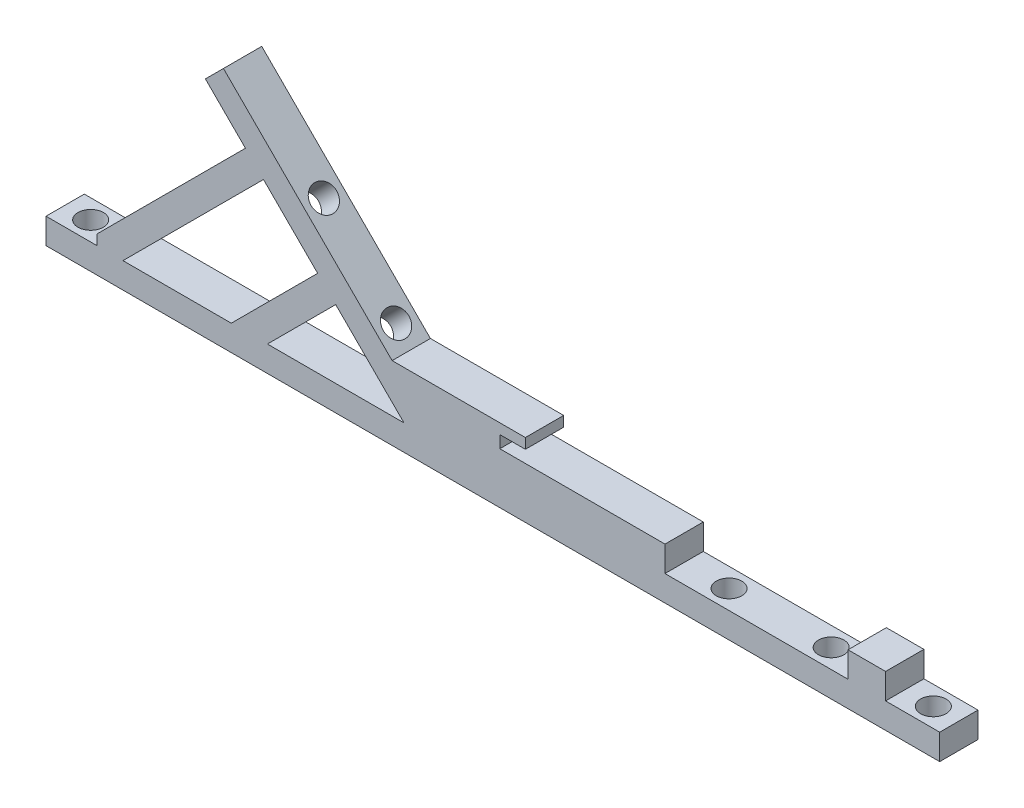
ISO-10303-21;
HEADER;
FILE_DESCRIPTION(('STEP AP214'),'2;1');
FILE_NAME('part.step','',(''),(''),'','','');
FILE_SCHEMA(('AUTOMOTIVE_DESIGN { 1 0 10303 214 1 1 1 1 }'));
ENDSEC;
DATA;
#1=APPLICATION_CONTEXT('core data for automotive mechanical design processes');
#2=APPLICATION_PROTOCOL_DEFINITION('international standard','automotive_design',2000,#1);
#3=PRODUCT_CONTEXT('',#1,'mechanical');
#4=PRODUCT('Part','Part','',(#3));
#5=PRODUCT_RELATED_PRODUCT_CATEGORY('part','',(#4));
#6=PRODUCT_DEFINITION_FORMATION('','',#4);
#7=PRODUCT_DEFINITION_CONTEXT('part definition',#1,'design');
#8=PRODUCT_DEFINITION('design','',#6,#7);
#9=PRODUCT_DEFINITION_SHAPE('','',#8);
#10=(LENGTH_UNIT() NAMED_UNIT(*) SI_UNIT(.MILLI.,.METRE.));
#11=(NAMED_UNIT(*) PLANE_ANGLE_UNIT() SI_UNIT($,.RADIAN.));
#12=(NAMED_UNIT(*) SI_UNIT($,.STERADIAN.) SOLID_ANGLE_UNIT());
#13=UNCERTAINTY_MEASURE_WITH_UNIT(LENGTH_MEASURE(1.E-05),#10,'distance_accuracy_value','');
#14=(GEOMETRIC_REPRESENTATION_CONTEXT(3) GLOBAL_UNCERTAINTY_ASSIGNED_CONTEXT((#13)) GLOBAL_UNIT_ASSIGNED_CONTEXT((#10,
#11,#12)) REPRESENTATION_CONTEXT('',''));
#15=CARTESIAN_POINT('',(0.,0.,0.));
#16=DIRECTION('',(0.,0.,1.));
#17=DIRECTION('',(1.,0.,0.));
#18=AXIS2_PLACEMENT_3D('',#15,#16,#17);
#19=CARTESIAN_POINT('',(0.,3.175,0.));
#20=DIRECTION('',(0.,-1.,0.));
#21=DIRECTION('',(0.,0.,-1.));
#22=AXIS2_PLACEMENT_3D('',#19,#20,#21);
#23=PLANE('',#22);
#24=CARTESIAN_POINT('',(0.,3.175,0.));
#25=DIRECTION('',(0.,1.,0.));
#26=DIRECTION('',(0.,0.,1.));
#27=AXIS2_PLACEMENT_3D('',#24,#25,#26);
#28=CIRCLE('',#27,1.5875);
#29=CARTESIAN_POINT('',(0.,3.175,1.5875));
#30=VERTEX_POINT('',#29);
#31=EDGE_CURVE('E562',#30,#30,#28,.T.);
#32=ORIENTED_EDGE('',*,*,#31,.F.);
#33=EDGE_LOOP('',(#32));
#34=FACE_BOUND('',#33,.T.);
#35=CARTESIAN_POINT('',(12.7,3.175,0.));
#36=DIRECTION('',(0.,1.,0.));
#37=DIRECTION('',(0.,0.,1.));
#38=AXIS2_PLACEMENT_3D('',#35,#36,#37);
#39=CIRCLE('',#38,1.5875);
#40=CARTESIAN_POINT('',(12.7,3.175,1.5875));
#41=VERTEX_POINT('',#40);
#42=EDGE_CURVE('E338',#41,#41,#39,.T.);
#43=ORIENTED_EDGE('',*,*,#42,.F.);
#44=EDGE_LOOP('',(#43));
#45=FACE_BOUND('',#44,.T.);
#46=DIRECTION('',(1.,0.,0.));
#47=VECTOR('',#46,1.);
#48=CARTESIAN_POINT('',(-82.55,3.175,2.38125));
#49=LINE('',#48,#47);
#50=CARTESIAN_POINT('',(-5.58425134997997,3.175,2.38125));
#51=VERTEX_POINT('',#50);
#52=CARTESIAN_POINT('',(17.1793113595147,3.175,2.38125));
#53=VERTEX_POINT('',#52);
#54=EDGE_CURVE('E75',#51,#53,#49,.T.);
#55=ORIENTED_EDGE('',*,*,#54,.T.);
#56=DIRECTION('',(0.,0.,1.));
#57=VECTOR('',#56,1.);
#58=CARTESIAN_POINT('',(17.1793113595147,3.175,-2.38125));
#59=LINE('',#58,#57);
#60=CARTESIAN_POINT('',(17.1793113595147,3.175,-2.38125));
#61=VERTEX_POINT('',#60);
#62=EDGE_CURVE('E296',#61,#53,#59,.T.);
#63=ORIENTED_EDGE('',*,*,#62,.F.);
#64=DIRECTION('',(-1.,0.,0.));
#65=VECTOR('',#64,1.);
#66=CARTESIAN_POINT('',(-82.55,3.175,-2.38125));
#67=LINE('',#66,#65);
#68=CARTESIAN_POINT('',(-5.58425134997997,3.175,-2.38125));
#69=VERTEX_POINT('',#68);
#70=EDGE_CURVE('E281',#61,#69,#67,.T.);
#71=ORIENTED_EDGE('',*,*,#70,.T.);
#72=DIRECTION('',(0.,0.,1.));
#73=VECTOR('',#72,1.);
#74=CARTESIAN_POINT('',(-5.58425134997997,3.175,-2.38125));
#75=LINE('',#74,#73);
#76=EDGE_CURVE('E501',#69,#51,#75,.T.);
#77=ORIENTED_EDGE('',*,*,#76,.T.);
#78=EDGE_LOOP('',(#55,#63,#71,#77));
#79=FACE_BOUND('',#78,.T.);
#80=ADVANCED_FACE('F46',(#34,#45,#79),#23,.F.);
#81=CARTESIAN_POINT('',(25.4,3.175,0.));
#82=DIRECTION('',(0.,1.,0.));
#83=DIRECTION('',(0.,0.,1.));
#84=AXIS2_PLACEMENT_3D('',#81,#82,#83);
#85=CIRCLE('',#84,1.5875);
#86=CARTESIAN_POINT('',(25.4,3.175,1.5875));
#87=VERTEX_POINT('',#86);
#88=EDGE_CURVE('E327',#87,#87,#85,.T.);
#89=ORIENTED_EDGE('',*,*,#88,.F.);
#90=EDGE_LOOP('',(#89));
#91=FACE_BOUND('',#90,.T.);
#92=CARTESIAN_POINT('',(28.575,3.175,-2.38125));
#93=VERTEX_POINT('',#92);
#94=CARTESIAN_POINT('',(21.8464961052884,3.175,-2.38125));
#95=VERTEX_POINT('',#94);
#96=EDGE_CURVE('E292',#93,#95,#67,.T.);
#97=ORIENTED_EDGE('',*,*,#96,.T.);
#98=DIRECTION('',(0.,0.,1.));
#99=VECTOR('',#98,1.);
#100=CARTESIAN_POINT('',(21.8464961052884,3.175,-2.38125));
#101=LINE('',#100,#99);
#102=CARTESIAN_POINT('',(21.8464961052884,3.175,2.38125));
#103=VERTEX_POINT('',#102);
#104=EDGE_CURVE('E65',#95,#103,#101,.T.);
#105=ORIENTED_EDGE('',*,*,#104,.T.);
#106=CARTESIAN_POINT('',(28.575,3.175,2.38125));
#107=VERTEX_POINT('',#106);
#108=EDGE_CURVE('E574',#103,#107,#49,.T.);
#109=ORIENTED_EDGE('',*,*,#108,.T.);
#110=DIRECTION('',(0.,0.,1.));
#111=VECTOR('',#110,1.);
#112=CARTESIAN_POINT('',(28.575,3.175,-2.38125));
#113=LINE('',#112,#111);
#114=EDGE_CURVE('E360',#93,#107,#113,.T.);
#115=ORIENTED_EDGE('',*,*,#114,.F.);
#116=EDGE_LOOP('',(#97,#105,#109,#115));
#117=FACE_BOUND('',#116,.T.);
#118=ADVANCED_FACE('F656',(#91,#117),#23,.F.);
#119=CARTESIAN_POINT('',(-55.0193596973271,3.175,2.38125));
#120=VERTEX_POINT('',#119);
#121=CARTESIAN_POINT('',(-38.033911485456,3.175,2.38125));
#122=VERTEX_POINT('',#121);
#123=EDGE_CURVE('E631',#120,#122,#49,.T.);
#124=ORIENTED_EDGE('',*,*,#123,.T.);
#125=DIRECTION('',(0.,0.,1.));
#126=VECTOR('',#125,1.);
#127=CARTESIAN_POINT('',(-38.033911485456,3.175,-2.38125));
#128=LINE('',#127,#126);
#129=CARTESIAN_POINT('',(-38.033911485456,3.175,-2.38125));
#130=VERTEX_POINT('',#129);
#131=EDGE_CURVE('E504',#130,#122,#128,.T.);
#132=ORIENTED_EDGE('',*,*,#131,.F.);
#133=CARTESIAN_POINT('',(-55.0193596973271,3.175,-2.38125));
#134=VERTEX_POINT('',#133);
#135=EDGE_CURVE('E293',#130,#134,#67,.T.);
#136=ORIENTED_EDGE('',*,*,#135,.T.);
#137=DIRECTION('',(0.,0.,1.));
#138=VECTOR('',#137,1.);
#139=CARTESIAN_POINT('',(-55.0193596973271,3.175,-2.38125));
#140=LINE('',#139,#138);
#141=EDGE_CURVE('E511',#134,#120,#140,.T.);
#142=ORIENTED_EDGE('',*,*,#141,.T.);
#143=EDGE_LOOP('',(#124,#132,#136,#142));
#144=FACE_BOUND('',#143,.T.);
#145=ADVANCED_FACE('F616',(#144),#23,.F.);
#146=CARTESIAN_POINT('',(-72.9798719394654,3.175,2.38125));
#147=VERTEX_POINT('',#146);
#148=CARTESIAN_POINT('',(-59.5094877578617,3.175,2.38125));
#149=VERTEX_POINT('',#148);
#150=EDGE_CURVE('E578',#147,#149,#49,.T.);
#151=ORIENTED_EDGE('',*,*,#150,.T.);
#152=DIRECTION('',(0.,0.,1.));
#153=VECTOR('',#152,1.);
#154=CARTESIAN_POINT('',(-59.5094877578617,3.175,-2.38125));
#155=LINE('',#154,#153);
#156=CARTESIAN_POINT('',(-59.5094877578617,3.175,-2.38125));
#157=VERTEX_POINT('',#156);
#158=EDGE_CURVE('E514',#157,#149,#155,.T.);
#159=ORIENTED_EDGE('',*,*,#158,.F.);
#160=CARTESIAN_POINT('',(-72.9798719394654,3.175,-2.38125));
#161=VERTEX_POINT('',#160);
#162=EDGE_CURVE('E609',#157,#161,#67,.T.);
#163=ORIENTED_EDGE('',*,*,#162,.T.);
#164=DIRECTION('',(0.,0.,1.));
#165=VECTOR('',#164,1.);
#166=CARTESIAN_POINT('',(-72.9798719394654,3.175,-2.38125));
#167=LINE('',#166,#165);
#168=EDGE_CURVE('E524',#161,#147,#167,.T.);
#169=ORIENTED_EDGE('',*,*,#168,.T.);
#170=EDGE_LOOP('',(#151,#159,#163,#169));
#171=FACE_BOUND('',#170,.T.);
#172=ADVANCED_FACE('F649',(#171),#23,.F.);
#173=CARTESIAN_POINT('',(-82.55,3.175,2.38125));
#174=VERTEX_POINT('',#173);
#175=CARTESIAN_POINT('',(-76.185480906041,3.175,2.38125));
#176=VERTEX_POINT('',#175);
#177=EDGE_CURVE('E576',#174,#176,#49,.T.);
#178=ORIENTED_EDGE('',*,*,#177,.T.);
#179=DIRECTION('',(0.,0.,1.));
#180=VECTOR('',#179,1.);
#181=CARTESIAN_POINT('',(-76.185480906041,3.175,-2.38125));
#182=LINE('',#181,#180);
#183=CARTESIAN_POINT('',(-76.185480906041,3.175,-2.38125));
#184=VERTEX_POINT('',#183);
#185=EDGE_CURVE('E527',#184,#176,#182,.T.);
#186=ORIENTED_EDGE('',*,*,#185,.F.);
#187=CARTESIAN_POINT('',(-82.55,3.175,-2.38125));
#188=VERTEX_POINT('',#187);
#189=EDGE_CURVE('E295',#184,#188,#67,.T.);
#190=ORIENTED_EDGE('',*,*,#189,.T.);
#191=DIRECTION('',(0.,0.,1.));
#192=VECTOR('',#191,1.);
#193=CARTESIAN_POINT('',(-82.55,3.175,2.38125));
#194=LINE('',#193,#192);
#195=EDGE_CURVE('E570',#188,#174,#194,.T.);
#196=ORIENTED_EDGE('',*,*,#195,.T.);
#197=EDGE_LOOP('',(#178,#186,#190,#196));
#198=FACE_BOUND('',#197,.T.);
#199=CARTESIAN_POINT('',(-79.375,3.175,0.));
#200=DIRECTION('',(0.,1.,0.));
#201=DIRECTION('',(0.,0.,1.));
#202=AXIS2_PLACEMENT_3D('',#199,#200,#201);
#203=CIRCLE('',#202,1.5875);
#204=CARTESIAN_POINT('',(-79.375,3.175,1.5875));
#205=VERTEX_POINT('',#204);
#206=EDGE_CURVE('E554',#205,#205,#203,.T.);
#207=ORIENTED_EDGE('',*,*,#206,.F.);
#208=EDGE_LOOP('',(#207));
#209=FACE_BOUND('',#208,.T.);
#210=ADVANCED_FACE('F605',(#198,#209),#23,.F.);
#211=CARTESIAN_POINT('',(0.,0.,0.));
#212=DIRECTION('',(0.,-1.,0.));
#213=DIRECTION('',(0.,0.,-1.));
#214=AXIS2_PLACEMENT_3D('',#211,#212,#213);
#215=PLANE('',#214);
#216=CARTESIAN_POINT('',(12.7,0.,0.));
#217=DIRECTION('',(0.,1.,0.));
#218=DIRECTION('',(0.,0.,1.));
#219=AXIS2_PLACEMENT_3D('',#216,#217,#218);
#220=CIRCLE('',#219,1.5875);
#221=CARTESIAN_POINT('',(12.7,0.,1.5875));
#222=VERTEX_POINT('',#221);
#223=EDGE_CURVE('E333',#222,#222,#220,.T.);
#224=ORIENTED_EDGE('',*,*,#223,.T.);
#225=EDGE_LOOP('',(#224));
#226=FACE_BOUND('',#225,.T.);
#227=CARTESIAN_POINT('',(25.4,0.,0.));
#228=DIRECTION('',(0.,1.,0.));
#229=DIRECTION('',(0.,0.,1.));
#230=AXIS2_PLACEMENT_3D('',#227,#228,#229);
#231=CIRCLE('',#230,1.5875);
#232=CARTESIAN_POINT('',(25.4,0.,1.5875));
#233=VERTEX_POINT('',#232);
#234=EDGE_CURVE('E342',#233,#233,#231,.T.);
#235=ORIENTED_EDGE('',*,*,#234,.T.);
#236=EDGE_LOOP('',(#235));
#237=FACE_BOUND('',#236,.T.);
#238=CARTESIAN_POINT('',(0.,0.,0.));
#239=DIRECTION('',(0.,1.,0.));
#240=DIRECTION('',(0.,0.,1.));
#241=AXIS2_PLACEMENT_3D('',#238,#239,#240);
#242=CIRCLE('',#241,1.5875);
#243=CARTESIAN_POINT('',(0.,0.,1.5875));
#244=VERTEX_POINT('',#243);
#245=EDGE_CURVE('E558',#244,#244,#242,.T.);
#246=ORIENTED_EDGE('',*,*,#245,.T.);
#247=EDGE_LOOP('',(#246));
#248=FACE_BOUND('',#247,.T.);
#249=DIRECTION('',(0.,0.,1.));
#250=VECTOR('',#249,1.);
#251=CARTESIAN_POINT('',(-82.55,0.,2.38125));
#252=LINE('',#251,#250);
#253=CARTESIAN_POINT('',(-82.55,0.,-2.38125));
#254=VERTEX_POINT('',#253);
#255=CARTESIAN_POINT('',(-82.55,0.,2.38125));
#256=VERTEX_POINT('',#255);
#257=EDGE_CURVE('E566',#254,#256,#252,.T.);
#258=ORIENTED_EDGE('',*,*,#257,.F.);
#259=DIRECTION('',(-1.,0.,0.));
#260=VECTOR('',#259,1.);
#261=CARTESIAN_POINT('',(-82.55,0.,-2.38125));
#262=LINE('',#261,#260);
#263=CARTESIAN_POINT('',(28.575,0.,-2.38125));
#264=VERTEX_POINT('',#263);
#265=EDGE_CURVE('E575',#264,#254,#262,.T.);
#266=ORIENTED_EDGE('',*,*,#265,.F.);
#267=DIRECTION('',(0.,0.,-1.));
#268=VECTOR('',#267,1.);
#269=CARTESIAN_POINT('',(28.575,0.,2.38125));
#270=LINE('',#269,#268);
#271=CARTESIAN_POINT('',(28.575,0.,2.38125));
#272=VERTEX_POINT('',#271);
#273=EDGE_CURVE('E352',#272,#264,#270,.T.);
#274=ORIENTED_EDGE('',*,*,#273,.F.);
#275=DIRECTION('',(1.,0.,0.));
#276=VECTOR('',#275,1.);
#277=CARTESIAN_POINT('',(-82.55,0.,2.38125));
#278=LINE('',#277,#276);
#279=EDGE_CURVE('E584',#256,#272,#278,.T.);
#280=ORIENTED_EDGE('',*,*,#279,.F.);
#281=EDGE_LOOP('',(#258,#266,#274,#280));
#282=FACE_BOUND('',#281,.T.);
#283=CARTESIAN_POINT('',(-79.375,0.,0.));
#284=DIRECTION('',(0.,1.,0.));
#285=DIRECTION('',(0.,0.,1.));
#286=AXIS2_PLACEMENT_3D('',#283,#284,#285);
#287=CIRCLE('',#286,1.5875);
#288=CARTESIAN_POINT('',(-79.375,0.,1.5875));
#289=VERTEX_POINT('',#288);
#290=EDGE_CURVE('E497',#289,#289,#287,.T.);
#291=ORIENTED_EDGE('',*,*,#290,.T.);
#292=EDGE_LOOP('',(#291));
#293=FACE_BOUND('',#292,.T.);
#294=ADVANCED_FACE('F596',(#226,#237,#248,#282,#293),#215,.T.);
#295=CARTESIAN_POINT('',(-82.55,3.175,2.38125));
#296=DIRECTION('',(1.,0.,0.));
#297=DIRECTION('',(0.,0.,-1.));
#298=AXIS2_PLACEMENT_3D('',#295,#296,#297);
#299=PLANE('',#298);
#300=ORIENTED_EDGE('',*,*,#257,.T.);
#301=DIRECTION('',(0.,-1.,0.));
#302=VECTOR('',#301,1.);
#303=CARTESIAN_POINT('',(-82.55,3.175,2.38125));
#304=LINE('',#303,#302);
#305=EDGE_CURVE('E12',#174,#256,#304,.T.);
#306=ORIENTED_EDGE('',*,*,#305,.F.);
#307=ORIENTED_EDGE('',*,*,#195,.F.);
#308=DIRECTION('',(0.,-1.,0.));
#309=VECTOR('',#308,1.);
#310=CARTESIAN_POINT('',(-82.55,3.175,-2.38125));
#311=LINE('',#310,#309);
#312=EDGE_CURVE('E55',#188,#254,#311,.T.);
#313=ORIENTED_EDGE('',*,*,#312,.T.);
#314=EDGE_LOOP('',(#300,#306,#307,#313));
#315=FACE_BOUND('',#314,.T.);
#316=ADVANCED_FACE('F48',(#315),#299,.F.);
#317=CARTESIAN_POINT('',(-82.55,3.175,2.38125));
#318=DIRECTION('',(0.,0.,-1.));
#319=DIRECTION('',(-1.,0.,0.));
#320=AXIS2_PLACEMENT_3D('',#317,#318,#319);
#321=PLANE('',#320);
#322=DIRECTION('',(0.707106781186546,-0.707106781186549,0.));
#323=VECTOR('',#322,1.);
#324=CARTESIAN_POINT('',(-17.4294557427281,-17.429455742728,2.38125));
#325=LINE('',#324,#323);
#326=CARTESIAN_POINT('',(-46.5266355913915,11.6677241059355,2.38125));
#327=VERTEX_POINT('',#326);
#328=EDGE_CURVE('E466',#327,#122,#325,.T.);
#329=ORIENTED_EDGE('',*,*,#328,.T.);
#330=ORIENTED_EDGE('',*,*,#123,.F.);
#331=DIRECTION('',(-0.707106781186549,-0.707106781186546,0.));
#332=VECTOR('',#331,1.);
#333=CARTESIAN_POINT('',(-29.0971798486634,29.0971798486636,2.38125));
#334=LINE('',#333,#332);
#335=EDGE_CURVE('E483',#327,#120,#334,.T.);
#336=ORIENTED_EDGE('',*,*,#335,.F.);
#337=EDGE_LOOP('',(#329,#330,#336));
#338=FACE_BOUND('',#337,.T.);
#339=DIRECTION('',(-0.707106781186549,-0.707106781186546,0.));
#340=VECTOR('',#339,1.);
#341=CARTESIAN_POINT('',(-31.3422438789307,31.3422438789309,2.38125));
#342=LINE('',#341,#340);
#343=CARTESIAN_POINT('',(-48.7716996216588,13.9127881362028,2.38125));
#344=VERTEX_POINT('',#343);
#345=EDGE_CURVE('E479',#344,#149,#342,.T.);
#346=ORIENTED_EDGE('',*,*,#345,.T.);
#347=ORIENTED_EDGE('',*,*,#150,.F.);
#348=DIRECTION('',(-0.707106781186549,-0.707106781186546,0.));
#349=VECTOR('',#348,1.);
#350=CARTESIAN_POINT('',(-38.0774359697326,38.0774359697327,2.38125));
#351=LINE('',#350,#349);
#352=CARTESIAN_POINT('',(-55.5068917124607,20.6479802270047,2.38125));
#353=VERTEX_POINT('',#352);
#354=EDGE_CURVE('E475',#353,#147,#351,.T.);
#355=ORIENTED_EDGE('',*,*,#354,.F.);
#356=EDGE_CURVE('E467',#353,#344,#325,.T.);
#357=ORIENTED_EDGE('',*,*,#356,.T.);
#358=EDGE_LOOP('',(#346,#347,#355,#357));
#359=FACE_BOUND('',#358,.T.);
#360=ORIENTED_EDGE('',*,*,#279,.T.);
#361=DIRECTION('',(0.,-1.,0.));
#362=VECTOR('',#361,1.);
#363=CARTESIAN_POINT('',(28.575,3.175,2.38125));
#364=LINE('',#363,#362);
#365=EDGE_CURVE('E337',#107,#272,#364,.T.);
#366=ORIENTED_EDGE('',*,*,#365,.F.);
#367=ORIENTED_EDGE('',*,*,#108,.F.);
#368=DIRECTION('',(0.,1.,0.));
#369=VECTOR('',#368,1.);
#370=CARTESIAN_POINT('',(21.8464961052884,3.175,2.38125));
#371=LINE('',#370,#369);
#372=CARTESIAN_POINT('',(21.8464961052884,6.35,2.38125));
#373=VERTEX_POINT('',#372);
#374=EDGE_CURVE('E314',#103,#373,#371,.T.);
#375=ORIENTED_EDGE('',*,*,#374,.T.);
#376=DIRECTION('',(-1.,0.,0.));
#377=VECTOR('',#376,1.);
#378=CARTESIAN_POINT('',(17.1793113595147,6.35,2.38125));
#379=LINE('',#378,#377);
#380=CARTESIAN_POINT('',(17.1793113595147,6.35,2.38125));
#381=VERTEX_POINT('',#380);
#382=EDGE_CURVE('E307',#373,#381,#379,.T.);
#383=ORIENTED_EDGE('',*,*,#382,.T.);
#384=DIRECTION('',(0.,-1.,0.));
#385=VECTOR('',#384,1.);
#386=CARTESIAN_POINT('',(17.1793113595147,3.175,2.38125));
#387=LINE('',#386,#385);
#388=EDGE_CURVE('E319',#381,#53,#387,.T.);
#389=ORIENTED_EDGE('',*,*,#388,.T.);
#390=ORIENTED_EDGE('',*,*,#54,.F.);
#391=DIRECTION('',(0.,1.,0.));
#392=VECTOR('',#391,1.);
#393=CARTESIAN_POINT('',(-5.58425134997997,0.,2.38125));
#394=LINE('',#393,#392);
#395=CARTESIAN_POINT('',(-5.58425134997997,6.35,2.38125));
#396=VERTEX_POINT('',#395);
#397=EDGE_CURVE('E487',#51,#396,#394,.T.);
#398=ORIENTED_EDGE('',*,*,#397,.T.);
#399=DIRECTION('',(-1.,0.,0.));
#400=VECTOR('',#399,1.);
#401=CARTESIAN_POINT('',(0.,6.35,2.38125));
#402=LINE('',#401,#400);
#403=CARTESIAN_POINT('',(-26.1180443421682,6.35,2.38125));
#404=VERTEX_POINT('',#403);
#405=EDGE_CURVE('E386',#396,#404,#402,.T.);
#406=ORIENTED_EDGE('',*,*,#405,.T.);
#407=DIRECTION('',(0.,1.,0.));
#408=VECTOR('',#407,1.);
#409=CARTESIAN_POINT('',(-26.1180443421682,0.,2.38125));
#410=LINE('',#409,#408);
#411=CARTESIAN_POINT('',(-26.1180443421682,7.874,2.38125));
#412=VERTEX_POINT('',#411);
#413=EDGE_CURVE('E369',#404,#412,#410,.T.);
#414=ORIENTED_EDGE('',*,*,#413,.T.);
#415=DIRECTION('',(1.,0.,0.));
#416=VECTOR('',#415,1.);
#417=CARTESIAN_POINT('',(0.,7.874,2.38125));
#418=LINE('',#417,#416);
#419=CARTESIAN_POINT('',(-22.9430443421682,7.874,2.38125));
#420=VERTEX_POINT('',#419);
#421=EDGE_CURVE('E441',#412,#420,#418,.T.);
#422=ORIENTED_EDGE('',*,*,#421,.T.);
#423=DIRECTION('',(0.,1.,0.));
#424=VECTOR('',#423,1.);
#425=CARTESIAN_POINT('',(-22.9430443421682,0.,2.38125));
#426=LINE('',#425,#424);
#427=CARTESIAN_POINT('',(-22.9430443421682,9.144,2.38125));
#428=VERTEX_POINT('',#427);
#429=EDGE_CURVE('E445',#420,#428,#426,.T.);
#430=ORIENTED_EDGE('',*,*,#429,.T.);
#431=DIRECTION('',(1.,0.,0.));
#432=VECTOR('',#431,1.);
#433=CARTESIAN_POINT('',(0.,9.144,2.38125));
#434=LINE('',#433,#432);
#435=CARTESIAN_POINT('',(-39.5127834249214,9.14399999999999,2.38125));
#436=VERTEX_POINT('',#435);
#437=EDGE_CURVE('E449',#436,#428,#434,.T.);
#438=ORIENTED_EDGE('',*,*,#437,.F.);
#439=DIRECTION('',(-0.707106781186547,0.707106781186549,0.));
#440=VECTOR('',#439,1.);
#441=CARTESIAN_POINT('',(-15.1843917124608,-15.1843917124607,2.38125));
#442=LINE('',#441,#440);
#443=CARTESIAN_POINT('',(-60.4845517881289,30.1157683632075,2.38125));
#444=VERTEX_POINT('',#443);
#445=EDGE_CURVE('E453',#436,#444,#442,.T.);
#446=ORIENTED_EDGE('',*,*,#445,.T.);
#447=DIRECTION('',(-0.707106781186548,-0.707106781186547,0.));
#448=VECTOR('',#447,1.);
#449=CARTESIAN_POINT('',(-45.3001600756681,45.3001600756682,2.38125));
#450=LINE('',#449,#448);
#451=CARTESIAN_POINT('',(-62.7296158183961,27.8707043329402,2.38125));
#452=VERTEX_POINT('',#451);
#453=EDGE_CURVE('E457',#444,#452,#450,.T.);
#454=ORIENTED_EDGE('',*,*,#453,.T.);
#455=CARTESIAN_POINT('',(-57.751955742728,22.893044257272,2.38125));
#456=VERTEX_POINT('',#455);
#457=EDGE_CURVE('E461',#452,#456,#325,.T.);
#458=ORIENTED_EDGE('',*,*,#457,.T.);
#459=DIRECTION('',(-0.707106781186549,-0.707106781186546,0.));
#460=VECTOR('',#459,1.);
#461=CARTESIAN_POINT('',(-40.3224999999998,40.3225,2.38125));
#462=LINE('',#461,#460);
#463=CARTESIAN_POINT('',(-76.185480906041,4.45951909395904,2.38125));
#464=VERTEX_POINT('',#463);
#465=EDGE_CURVE('E465',#456,#464,#462,.T.);
#466=ORIENTED_EDGE('',*,*,#465,.T.);
#467=DIRECTION('',(0.,-1.,0.));
#468=VECTOR('',#467,1.);
#469=CARTESIAN_POINT('',(-76.185480906041,0.,2.38125));
#470=LINE('',#469,#468);
#471=EDGE_CURVE('E471',#464,#176,#470,.T.);
#472=ORIENTED_EDGE('',*,*,#471,.T.);
#473=ORIENTED_EDGE('',*,*,#177,.F.);
#474=ORIENTED_EDGE('',*,*,#305,.T.);
#475=EDGE_LOOP('',(#360,#366,#367,#375,#383,#389,#390,#398,#406,#414,#422,#430,#438,#446,#454,
#458,#466,#472,#473,#474));
#476=FACE_BOUND('',#475,.T.);
#477=ADVANCED_FACE('F601',(#338,#359,#476),#321,.F.);
#478=CARTESIAN_POINT('',(-82.55,3.175,-2.38125));
#479=DIRECTION('',(0.,0.,1.));
#480=DIRECTION('',(1.,0.,0.));
#481=AXIS2_PLACEMENT_3D('',#478,#479,#480);
#482=PLANE('',#481);
#483=ORIENTED_EDGE('',*,*,#135,.F.);
#484=DIRECTION('',(0.707106781186546,-0.707106781186549,0.));
#485=VECTOR('',#484,1.);
#486=CARTESIAN_POINT('',(-17.4294557427281,-17.429455742728,-2.38125));
#487=LINE('',#486,#485);
#488=CARTESIAN_POINT('',(-46.5266355913915,11.6677241059355,-2.38125));
#489=VERTEX_POINT('',#488);
#490=EDGE_CURVE('E410',#489,#130,#487,.T.);
#491=ORIENTED_EDGE('',*,*,#490,.F.);
#492=DIRECTION('',(-0.707106781186549,-0.707106781186546,0.));
#493=VECTOR('',#492,1.);
#494=CARTESIAN_POINT('',(-29.0971798486634,29.0971798486636,-2.38125));
#495=LINE('',#494,#493);
#496=EDGE_CURVE('E427',#489,#134,#495,.T.);
#497=ORIENTED_EDGE('',*,*,#496,.T.);
#498=EDGE_LOOP('',(#483,#491,#497));
#499=FACE_BOUND('',#498,.T.);
#500=ORIENTED_EDGE('',*,*,#162,.F.);
#501=DIRECTION('',(-0.707106781186549,-0.707106781186546,0.));
#502=VECTOR('',#501,1.);
#503=CARTESIAN_POINT('',(-31.3422438789307,31.3422438789309,-2.38125));
#504=LINE('',#503,#502);
#505=CARTESIAN_POINT('',(-48.7716996216588,13.9127881362028,-2.38125));
#506=VERTEX_POINT('',#505);
#507=EDGE_CURVE('E423',#506,#157,#504,.T.);
#508=ORIENTED_EDGE('',*,*,#507,.F.);
#509=CARTESIAN_POINT('',(-55.5068917124607,20.6479802270047,-2.38125));
#510=VERTEX_POINT('',#509);
#511=EDGE_CURVE('E411',#510,#506,#487,.T.);
#512=ORIENTED_EDGE('',*,*,#511,.F.);
#513=DIRECTION('',(-0.707106781186549,-0.707106781186546,0.));
#514=VECTOR('',#513,1.);
#515=CARTESIAN_POINT('',(-38.0774359697326,38.0774359697327,-2.38125));
#516=LINE('',#515,#514);
#517=EDGE_CURVE('E419',#510,#161,#516,.T.);
#518=ORIENTED_EDGE('',*,*,#517,.T.);
#519=EDGE_LOOP('',(#500,#508,#512,#518));
#520=FACE_BOUND('',#519,.T.);
#521=ORIENTED_EDGE('',*,*,#265,.T.);
#522=ORIENTED_EDGE('',*,*,#312,.F.);
#523=ORIENTED_EDGE('',*,*,#189,.F.);
#524=DIRECTION('',(0.,-1.,0.));
#525=VECTOR('',#524,1.);
#526=CARTESIAN_POINT('',(-76.185480906041,0.,-2.38125));
#527=LINE('',#526,#525);
#528=CARTESIAN_POINT('',(-76.185480906041,4.45951909395904,-2.38125));
#529=VERTEX_POINT('',#528);
#530=EDGE_CURVE('E415',#529,#184,#527,.T.);
#531=ORIENTED_EDGE('',*,*,#530,.F.);
#532=DIRECTION('',(-0.707106781186549,-0.707106781186546,0.));
#533=VECTOR('',#532,1.);
#534=CARTESIAN_POINT('',(-40.3224999999998,40.3225,-2.38125));
#535=LINE('',#534,#533);
#536=CARTESIAN_POINT('',(-57.751955742728,22.893044257272,-2.38125));
#537=VERTEX_POINT('',#536);
#538=EDGE_CURVE('E409',#537,#529,#535,.T.);
#539=ORIENTED_EDGE('',*,*,#538,.F.);
#540=CARTESIAN_POINT('',(-62.7296158183961,27.8707043329402,-2.38125));
#541=VERTEX_POINT('',#540);
#542=EDGE_CURVE('E405',#541,#537,#487,.T.);
#543=ORIENTED_EDGE('',*,*,#542,.F.);
#544=DIRECTION('',(-0.707106781186548,-0.707106781186547,0.));
#545=VECTOR('',#544,1.);
#546=CARTESIAN_POINT('',(-45.3001600756681,45.3001600756682,-2.38125));
#547=LINE('',#546,#545);
#548=CARTESIAN_POINT('',(-60.4845517881289,30.1157683632075,-2.38125));
#549=VERTEX_POINT('',#548);
#550=EDGE_CURVE('E401',#549,#541,#547,.T.);
#551=ORIENTED_EDGE('',*,*,#550,.F.);
#552=DIRECTION('',(-0.707106781186547,0.707106781186549,0.));
#553=VECTOR('',#552,1.);
#554=CARTESIAN_POINT('',(-15.1843917124608,-15.1843917124607,-2.38125));
#555=LINE('',#554,#553);
#556=CARTESIAN_POINT('',(-39.5127834249214,9.14399999999999,-2.38125));
#557=VERTEX_POINT('',#556);
#558=EDGE_CURVE('E397',#557,#549,#555,.T.);
#559=ORIENTED_EDGE('',*,*,#558,.F.);
#560=DIRECTION('',(1.,0.,0.));
#561=VECTOR('',#560,1.);
#562=CARTESIAN_POINT('',(0.,9.144,-2.38125));
#563=LINE('',#562,#561);
#564=CARTESIAN_POINT('',(-22.9430443421682,9.144,-2.38125));
#565=VERTEX_POINT('',#564);
#566=EDGE_CURVE('E394',#557,#565,#563,.T.);
#567=ORIENTED_EDGE('',*,*,#566,.T.);
#568=DIRECTION('',(0.,1.,0.));
#569=VECTOR('',#568,1.);
#570=CARTESIAN_POINT('',(-22.9430443421682,0.,-2.38125));
#571=LINE('',#570,#569);
#572=CARTESIAN_POINT('',(-22.9430443421682,7.874,-2.38125));
#573=VERTEX_POINT('',#572);
#574=EDGE_CURVE('E390',#573,#565,#571,.T.);
#575=ORIENTED_EDGE('',*,*,#574,.F.);
#576=DIRECTION('',(1.,0.,0.));
#577=VECTOR('',#576,1.);
#578=CARTESIAN_POINT('',(0.,7.874,-2.38125));
#579=LINE('',#578,#577);
#580=CARTESIAN_POINT('',(-26.1180443421682,7.874,-2.38125));
#581=VERTEX_POINT('',#580);
#582=EDGE_CURVE('E385',#581,#573,#579,.T.);
#583=ORIENTED_EDGE('',*,*,#582,.F.);
#584=DIRECTION('',(0.,1.,0.));
#585=VECTOR('',#584,1.);
#586=CARTESIAN_POINT('',(-26.1180443421682,0.,-2.38125));
#587=LINE('',#586,#585);
#588=CARTESIAN_POINT('',(-26.1180443421682,6.35,-2.38125));
#589=VERTEX_POINT('',#588);
#590=EDGE_CURVE('E381',#589,#581,#587,.T.);
#591=ORIENTED_EDGE('',*,*,#590,.F.);
#592=DIRECTION('',(-1.,0.,0.));
#593=VECTOR('',#592,1.);
#594=CARTESIAN_POINT('',(0.,6.35,-2.38125));
#595=LINE('',#594,#593);
#596=CARTESIAN_POINT('',(-5.58425134997997,6.35,-2.38125));
#597=VERTEX_POINT('',#596);
#598=EDGE_CURVE('E433',#597,#589,#595,.T.);
#599=ORIENTED_EDGE('',*,*,#598,.F.);
#600=DIRECTION('',(0.,1.,0.));
#601=VECTOR('',#600,1.);
#602=CARTESIAN_POINT('',(-5.58425134997997,0.,-2.38125));
#603=LINE('',#602,#601);
#604=EDGE_CURVE('E289',#69,#597,#603,.T.);
#605=ORIENTED_EDGE('',*,*,#604,.F.);
#606=ORIENTED_EDGE('',*,*,#70,.F.);
#607=DIRECTION('',(0.,-1.,0.));
#608=VECTOR('',#607,1.);
#609=CARTESIAN_POINT('',(17.1793113595147,3.175,-2.38125));
#610=LINE('',#609,#608);
#611=CARTESIAN_POINT('',(17.1793113595147,6.35,-2.38125));
#612=VERTEX_POINT('',#611);
#613=EDGE_CURVE('E285',#612,#61,#610,.T.);
#614=ORIENTED_EDGE('',*,*,#613,.F.);
#615=DIRECTION('',(-1.,0.,0.));
#616=VECTOR('',#615,1.);
#617=CARTESIAN_POINT('',(17.1793113595147,6.35,-2.38125));
#618=LINE('',#617,#616);
#619=CARTESIAN_POINT('',(21.8464961052884,6.35,-2.38125));
#620=VERTEX_POINT('',#619);
#621=EDGE_CURVE('E301',#620,#612,#618,.T.);
#622=ORIENTED_EDGE('',*,*,#621,.F.);
#623=DIRECTION('',(0.,1.,0.));
#624=VECTOR('',#623,1.);
#625=CARTESIAN_POINT('',(21.8464961052884,3.175,-2.38125));
#626=LINE('',#625,#624);
#627=EDGE_CURVE('E306',#95,#620,#626,.T.);
#628=ORIENTED_EDGE('',*,*,#627,.F.);
#629=ORIENTED_EDGE('',*,*,#96,.F.);
#630=DIRECTION('',(0.,1.,0.));
#631=VECTOR('',#630,1.);
#632=CARTESIAN_POINT('',(28.575,0.,-2.38125));
#633=LINE('',#632,#631);
#634=EDGE_CURVE('E356',#264,#93,#633,.T.);
#635=ORIENTED_EDGE('',*,*,#634,.F.);
#636=EDGE_LOOP('',(#521,#522,#523,#531,#539,#543,#551,#559,#567,#575,#583,#591,#599,#605,#606,
#614,#622,#628,#629,#635));
#637=FACE_BOUND('',#636,.T.);
#638=ADVANCED_FACE('F282',(#499,#520,#637),#482,.F.);
#639=CARTESIAN_POINT('',(0.,3.175,0.));
#640=DIRECTION('',(0.,-1.,0.));
#641=DIRECTION('',(0.,0.,-1.));
#642=AXIS2_PLACEMENT_3D('',#639,#640,#641);
#643=CYLINDRICAL_SURFACE('',#642,1.5875);
#644=ORIENTED_EDGE('',*,*,#31,.T.);
#645=EDGE_LOOP('',(#644));
#646=FACE_BOUND('',#645,.T.);
#647=ORIENTED_EDGE('',*,*,#245,.F.);
#648=EDGE_LOOP('',(#647));
#649=FACE_BOUND('',#648,.T.);
#650=ADVANCED_FACE('F768',(#646,#649),#643,.F.);
#651=CARTESIAN_POINT('',(-79.375,3.175,0.));
#652=DIRECTION('',(0.,-1.,0.));
#653=DIRECTION('',(0.,0.,-1.));
#654=AXIS2_PLACEMENT_3D('',#651,#652,#653);
#655=CYLINDRICAL_SURFACE('',#654,1.5875);
#656=ORIENTED_EDGE('',*,*,#206,.T.);
#657=EDGE_LOOP('',(#656));
#658=FACE_BOUND('',#657,.T.);
#659=ORIENTED_EDGE('',*,*,#290,.F.);
#660=EDGE_LOOP('',(#659));
#661=FACE_BOUND('',#660,.T.);
#662=ADVANCED_FACE('F943',(#658,#661),#655,.F.);
#663=CARTESIAN_POINT('',(-26.1180443421682,0.,-2.38125));
#664=DIRECTION('',(1.,0.,0.));
#665=DIRECTION('',(0.,0.,-1.));
#666=AXIS2_PLACEMENT_3D('',#663,#664,#665);
#667=PLANE('',#666);
#668=ORIENTED_EDGE('',*,*,#413,.F.);
#669=DIRECTION('',(0.,0.,1.));
#670=VECTOR('',#669,1.);
#671=CARTESIAN_POINT('',(-26.1180443421682,6.35,-2.38125));
#672=LINE('',#671,#670);
#673=EDGE_CURVE('E494',#589,#404,#672,.T.);
#674=ORIENTED_EDGE('',*,*,#673,.F.);
#675=ORIENTED_EDGE('',*,*,#590,.T.);
#676=DIRECTION('',(0.,0.,1.));
#677=VECTOR('',#676,1.);
#678=CARTESIAN_POINT('',(-26.1180443421682,7.874,-2.38125));
#679=LINE('',#678,#677);
#680=EDGE_CURVE('E437',#581,#412,#679,.T.);
#681=ORIENTED_EDGE('',*,*,#680,.T.);
#682=EDGE_LOOP('',(#668,#674,#675,#681));
#683=FACE_BOUND('',#682,.T.);
#684=ADVANCED_FACE('F676',(#683),#667,.T.);
#685=CARTESIAN_POINT('',(0.,6.35,-2.38125));
#686=DIRECTION('',(0.,1.,0.));
#687=DIRECTION('',(-1.,0.,0.));
#688=AXIS2_PLACEMENT_3D('',#685,#686,#687);
#689=PLANE('',#688);
#690=ORIENTED_EDGE('',*,*,#405,.F.);
#691=DIRECTION('',(0.,0.,1.));
#692=VECTOR('',#691,1.);
#693=CARTESIAN_POINT('',(-5.58425134997997,6.35,-2.38125));
#694=LINE('',#693,#692);
#695=EDGE_CURVE('E498',#597,#396,#694,.T.);
#696=ORIENTED_EDGE('',*,*,#695,.F.);
#697=ORIENTED_EDGE('',*,*,#598,.T.);
#698=ORIENTED_EDGE('',*,*,#673,.T.);
#699=EDGE_LOOP('',(#690,#696,#697,#698));
#700=FACE_BOUND('',#699,.T.);
#701=ADVANCED_FACE('F672',(#700),#689,.T.);
#702=CARTESIAN_POINT('',(-5.58425134997997,0.,-2.38125));
#703=DIRECTION('',(1.,0.,0.));
#704=DIRECTION('',(0.,0.,-1.));
#705=AXIS2_PLACEMENT_3D('',#702,#703,#704);
#706=PLANE('',#705);
#707=ORIENTED_EDGE('',*,*,#397,.F.);
#708=ORIENTED_EDGE('',*,*,#76,.F.);
#709=ORIENTED_EDGE('',*,*,#604,.T.);
#710=ORIENTED_EDGE('',*,*,#695,.T.);
#711=EDGE_LOOP('',(#707,#708,#709,#710));
#712=FACE_BOUND('',#711,.T.);
#713=ADVANCED_FACE('F670',(#712),#706,.T.);
#714=CARTESIAN_POINT('',(-17.4294557427281,-17.429455742728,-2.38125));
#715=DIRECTION('',(-0.707106781186549,-0.707106781186546,0.));
#716=DIRECTION('',(0.707106781186546,-0.707106781186549,0.));
#717=AXIS2_PLACEMENT_3D('',#714,#715,#716);
#718=PLANE('',#717);
#719=CARTESIAN_POINT('',(-43.6465715611242,8.78766007566824,0.));
#720=DIRECTION('',(-0.707106781186549,-0.707106781186546,0.));
#721=DIRECTION('',(0.707106781186546,-0.707106781186549,0.));
#722=AXIS2_PLACEMENT_3D('',#719,#720,#721);
#723=CIRCLE('',#722,1.5875);
#724=CARTESIAN_POINT('',(-42.5240395459906,7.66512806053459,0.));
#725=VERTEX_POINT('',#724);
#726=EDGE_CURVE('E374',#725,#725,#723,.F.);
#727=ORIENTED_EDGE('',*,*,#726,.T.);
#728=EDGE_LOOP('',(#727));
#729=FACE_BOUND('',#728,.T.);
#730=ORIENTED_EDGE('',*,*,#328,.F.);
#731=DIRECTION('',(0.,0.,1.));
#732=VECTOR('',#731,1.);
#733=CARTESIAN_POINT('',(-46.5266355913915,11.6677241059355,-2.38125));
#734=LINE('',#733,#732);
#735=EDGE_CURVE('E508',#489,#327,#734,.T.);
#736=ORIENTED_EDGE('',*,*,#735,.F.);
#737=ORIENTED_EDGE('',*,*,#490,.T.);
#738=ORIENTED_EDGE('',*,*,#131,.T.);
#739=EDGE_LOOP('',(#730,#736,#737,#738));
#740=FACE_BOUND('',#739,.T.);
#741=ADVANCED_FACE('F633',(#729,#740),#718,.T.);
#742=CARTESIAN_POINT('',(-29.0971798486634,29.0971798486636,-2.38125));
#743=DIRECTION('',(-0.707106781186546,0.707106781186549,0.));
#744=DIRECTION('',(-0.707106781186549,-0.707106781186546,0.));
#745=AXIS2_PLACEMENT_3D('',#742,#743,#744);
#746=PLANE('',#745);
#747=ORIENTED_EDGE('',*,*,#335,.T.);
#748=ORIENTED_EDGE('',*,*,#141,.F.);
#749=ORIENTED_EDGE('',*,*,#496,.F.);
#750=ORIENTED_EDGE('',*,*,#735,.T.);
#751=EDGE_LOOP('',(#747,#748,#749,#750));
#752=FACE_BOUND('',#751,.T.);
#753=ADVANCED_FACE('F625',(#752),#746,.F.);
#754=CARTESIAN_POINT('',(-31.3422438789307,31.3422438789309,-2.38125));
#755=DIRECTION('',(-0.707106781186546,0.707106781186549,0.));
#756=DIRECTION('',(-0.707106781186549,-0.707106781186546,0.));
#757=AXIS2_PLACEMENT_3D('',#754,#755,#756);
#758=PLANE('',#757);
#759=ORIENTED_EDGE('',*,*,#345,.F.);
#760=DIRECTION('',(0.,0.,1.));
#761=VECTOR('',#760,1.);
#762=CARTESIAN_POINT('',(-48.7716996216588,13.9127881362028,-2.38125));
#763=LINE('',#762,#761);
#764=EDGE_CURVE('E518',#506,#344,#763,.T.);
#765=ORIENTED_EDGE('',*,*,#764,.F.);
#766=ORIENTED_EDGE('',*,*,#507,.T.);
#767=ORIENTED_EDGE('',*,*,#158,.T.);
#768=EDGE_LOOP('',(#759,#765,#766,#767));
#769=FACE_BOUND('',#768,.T.);
#770=ADVANCED_FACE('F648',(#769),#758,.T.);
#771=CARTESIAN_POINT('',(-52.6268276821934,17.7679161967374,0.));
#772=DIRECTION('',(-0.707106781186549,-0.707106781186546,0.));
#773=DIRECTION('',(0.707106781186546,-0.707106781186549,0.));
#774=AXIS2_PLACEMENT_3D('',#771,#772,#773);
#775=CIRCLE('',#774,1.5875);
#776=CARTESIAN_POINT('',(-51.5042956670597,16.6453841816038,0.));
#777=VERTEX_POINT('',#776);
#778=EDGE_CURVE('E370',#777,#777,#775,.F.);
#779=ORIENTED_EDGE('',*,*,#778,.T.);
#780=EDGE_LOOP('',(#779));
#781=FACE_BOUND('',#780,.T.);
#782=ORIENTED_EDGE('',*,*,#356,.F.);
#783=DIRECTION('',(0.,0.,1.));
#784=VECTOR('',#783,1.);
#785=CARTESIAN_POINT('',(-55.5068917124607,20.6479802270047,-2.38125));
#786=LINE('',#785,#784);
#787=EDGE_CURVE('E521',#510,#353,#786,.T.);
#788=ORIENTED_EDGE('',*,*,#787,.F.);
#789=ORIENTED_EDGE('',*,*,#511,.T.);
#790=ORIENTED_EDGE('',*,*,#764,.T.);
#791=EDGE_LOOP('',(#782,#788,#789,#790));
#792=FACE_BOUND('',#791,.T.);
#793=ADVANCED_FACE('F642',(#781,#792),#718,.T.);
#794=CARTESIAN_POINT('',(-38.0774359697326,38.0774359697327,-2.38125));
#795=DIRECTION('',(-0.707106781186546,0.707106781186549,0.));
#796=DIRECTION('',(-0.707106781186549,-0.707106781186546,0.));
#797=AXIS2_PLACEMENT_3D('',#794,#795,#796);
#798=PLANE('',#797);
#799=ORIENTED_EDGE('',*,*,#354,.T.);
#800=ORIENTED_EDGE('',*,*,#168,.F.);
#801=ORIENTED_EDGE('',*,*,#517,.F.);
#802=ORIENTED_EDGE('',*,*,#787,.T.);
#803=EDGE_LOOP('',(#799,#800,#801,#802));
#804=FACE_BOUND('',#803,.T.);
#805=ADVANCED_FACE('F827',(#804),#798,.F.);
#806=CARTESIAN_POINT('',(-76.185480906041,0.,-2.38125));
#807=DIRECTION('',(-1.,0.,0.));
#808=DIRECTION('',(0.,0.,1.));
#809=AXIS2_PLACEMENT_3D('',#806,#807,#808);
#810=PLANE('',#809);
#811=ORIENTED_EDGE('',*,*,#471,.F.);
#812=DIRECTION('',(0.,0.,1.));
#813=VECTOR('',#812,1.);
#814=CARTESIAN_POINT('',(-76.185480906041,4.45951909395904,-2.38125));
#815=LINE('',#814,#813);
#816=EDGE_CURVE('E531',#529,#464,#815,.T.);
#817=ORIENTED_EDGE('',*,*,#816,.F.);
#818=ORIENTED_EDGE('',*,*,#530,.T.);
#819=ORIENTED_EDGE('',*,*,#185,.T.);
#820=EDGE_LOOP('',(#811,#817,#818,#819));
#821=FACE_BOUND('',#820,.T.);
#822=ADVANCED_FACE('F706',(#821),#810,.T.);
#823=CARTESIAN_POINT('',(-40.3224999999998,40.3225,-2.38125));
#824=DIRECTION('',(-0.707106781186546,0.707106781186549,0.));
#825=DIRECTION('',(-0.707106781186549,-0.707106781186546,0.));
#826=AXIS2_PLACEMENT_3D('',#823,#824,#825);
#827=PLANE('',#826);
#828=ORIENTED_EDGE('',*,*,#465,.F.);
#829=DIRECTION('',(0.,0.,1.));
#830=VECTOR('',#829,1.);
#831=CARTESIAN_POINT('',(-57.751955742728,22.893044257272,-2.38125));
#832=LINE('',#831,#830);
#833=EDGE_CURVE('E534',#537,#456,#832,.T.);
#834=ORIENTED_EDGE('',*,*,#833,.F.);
#835=ORIENTED_EDGE('',*,*,#538,.T.);
#836=ORIENTED_EDGE('',*,*,#816,.T.);
#837=EDGE_LOOP('',(#828,#834,#835,#836));
#838=FACE_BOUND('',#837,.T.);
#839=ADVANCED_FACE('F704',(#838),#827,.T.);
#840=ORIENTED_EDGE('',*,*,#457,.F.);
#841=DIRECTION('',(0.,0.,1.));
#842=VECTOR('',#841,1.);
#843=CARTESIAN_POINT('',(-62.7296158183961,27.8707043329402,-2.38125));
#844=LINE('',#843,#842);
#845=EDGE_CURVE('E537',#541,#452,#844,.T.);
#846=ORIENTED_EDGE('',*,*,#845,.F.);
#847=ORIENTED_EDGE('',*,*,#542,.T.);
#848=ORIENTED_EDGE('',*,*,#833,.T.);
#849=EDGE_LOOP('',(#840,#846,#847,#848));
#850=FACE_BOUND('',#849,.T.);
#851=ADVANCED_FACE('F700',(#850),#718,.T.);
#852=CARTESIAN_POINT('',(-45.3001600756681,45.3001600756682,-2.38125));
#853=DIRECTION('',(-0.707106781186547,0.707106781186548,0.));
#854=DIRECTION('',(-0.707106781186548,-0.707106781186547,0.));
#855=AXIS2_PLACEMENT_3D('',#852,#853,#854);
#856=PLANE('',#855);
#857=ORIENTED_EDGE('',*,*,#453,.F.);
#858=DIRECTION('',(0.,0.,1.));
#859=VECTOR('',#858,1.);
#860=CARTESIAN_POINT('',(-60.4845517881289,30.1157683632075,-2.38125));
#861=LINE('',#860,#859);
#862=EDGE_CURVE('E540',#549,#444,#861,.T.);
#863=ORIENTED_EDGE('',*,*,#862,.F.);
#864=ORIENTED_EDGE('',*,*,#550,.T.);
#865=ORIENTED_EDGE('',*,*,#845,.T.);
#866=EDGE_LOOP('',(#857,#863,#864,#865));
#867=FACE_BOUND('',#866,.T.);
#868=ADVANCED_FACE('F696',(#867),#856,.T.);
#869=CARTESIAN_POINT('',(-15.1843917124608,-15.1843917124607,-2.38125));
#870=DIRECTION('',(0.707106781186549,0.707106781186547,0.));
#871=DIRECTION('',(-0.707106781186547,0.707106781186549,0.));
#872=AXIS2_PLACEMENT_3D('',#869,#870,#871);
#873=PLANE('',#872);
#874=CARTESIAN_POINT('',(-50.3817636519261,20.0129802270047,0.));
#875=DIRECTION('',(0.707106781186549,0.707106781186546,0.));
#876=DIRECTION('',(-0.707106781186546,0.707106781186549,0.));
#877=AXIS2_PLACEMENT_3D('',#874,#875,#876);
#878=CIRCLE('',#877,1.5875);
#879=CARTESIAN_POINT('',(-51.5042956670597,21.1355122421383,0.));
#880=VERTEX_POINT('',#879);
#881=EDGE_CURVE('E365',#880,#880,#878,.T.);
#882=ORIENTED_EDGE('',*,*,#881,.F.);
#883=EDGE_LOOP('',(#882));
#884=FACE_BOUND('',#883,.T.);
#885=CARTESIAN_POINT('',(-41.401507530857,11.0327241059355,0.));
#886=DIRECTION('',(0.707106781186549,0.707106781186546,0.));
#887=DIRECTION('',(-0.707106781186546,0.707106781186549,0.));
#888=AXIS2_PLACEMENT_3D('',#885,#886,#887);
#889=CIRCLE('',#888,1.5875);
#890=CARTESIAN_POINT('',(-42.5240395459906,12.1552561210692,0.));
#891=VERTEX_POINT('',#890);
#892=EDGE_CURVE('E364',#891,#891,#889,.T.);
#893=ORIENTED_EDGE('',*,*,#892,.F.);
#894=EDGE_LOOP('',(#893));
#895=FACE_BOUND('',#894,.T.);
#896=ORIENTED_EDGE('',*,*,#445,.F.);
#897=DIRECTION('',(0.,0.,1.));
#898=VECTOR('',#897,1.);
#899=CARTESIAN_POINT('',(-39.5127834249214,9.14399999999999,-2.38125));
#900=LINE('',#899,#898);
#901=EDGE_CURVE('E543',#557,#436,#900,.T.);
#902=ORIENTED_EDGE('',*,*,#901,.F.);
#903=ORIENTED_EDGE('',*,*,#558,.T.);
#904=ORIENTED_EDGE('',*,*,#862,.T.);
#905=EDGE_LOOP('',(#896,#902,#903,#904));
#906=FACE_BOUND('',#905,.T.);
#907=ADVANCED_FACE('F690',(#884,#895,#906),#873,.T.);
#908=CARTESIAN_POINT('',(0.,9.144,-2.38125));
#909=DIRECTION('',(0.,-1.,0.));
#910=DIRECTION('',(1.,0.,0.));
#911=AXIS2_PLACEMENT_3D('',#908,#909,#910);
#912=PLANE('',#911);
#913=ORIENTED_EDGE('',*,*,#437,.T.);
#914=DIRECTION('',(0.,0.,1.));
#915=VECTOR('',#914,1.);
#916=CARTESIAN_POINT('',(-22.9430443421682,9.144,-2.38125));
#917=LINE('',#916,#915);
#918=EDGE_CURVE('E546',#565,#428,#917,.T.);
#919=ORIENTED_EDGE('',*,*,#918,.F.);
#920=ORIENTED_EDGE('',*,*,#566,.F.);
#921=ORIENTED_EDGE('',*,*,#901,.T.);
#922=EDGE_LOOP('',(#913,#919,#920,#921));
#923=FACE_BOUND('',#922,.T.);
#924=ADVANCED_FACE('F707',(#923),#912,.F.);
#925=CARTESIAN_POINT('',(-22.9430443421682,0.,-2.38125));
#926=DIRECTION('',(1.,0.,0.));
#927=DIRECTION('',(0.,0.,-1.));
#928=AXIS2_PLACEMENT_3D('',#925,#926,#927);
#929=PLANE('',#928);
#930=ORIENTED_EDGE('',*,*,#429,.F.);
#931=DIRECTION('',(0.,0.,1.));
#932=VECTOR('',#931,1.);
#933=CARTESIAN_POINT('',(-22.9430443421682,7.874,-2.38125));
#934=LINE('',#933,#932);
#935=EDGE_CURVE('E549',#573,#420,#934,.T.);
#936=ORIENTED_EDGE('',*,*,#935,.F.);
#937=ORIENTED_EDGE('',*,*,#574,.T.);
#938=ORIENTED_EDGE('',*,*,#918,.T.);
#939=EDGE_LOOP('',(#930,#936,#937,#938));
#940=FACE_BOUND('',#939,.T.);
#941=ADVANCED_FACE('F684',(#940),#929,.T.);
#942=CARTESIAN_POINT('',(0.,7.874,-2.38125));
#943=DIRECTION('',(0.,-1.,0.));
#944=DIRECTION('',(0.,0.,-1.));
#945=AXIS2_PLACEMENT_3D('',#942,#943,#944);
#946=PLANE('',#945);
#947=ORIENTED_EDGE('',*,*,#421,.F.);
#948=ORIENTED_EDGE('',*,*,#680,.F.);
#949=ORIENTED_EDGE('',*,*,#582,.T.);
#950=ORIENTED_EDGE('',*,*,#935,.T.);
#951=EDGE_LOOP('',(#947,#948,#949,#950));
#952=FACE_BOUND('',#951,.T.);
#953=ADVANCED_FACE('F680',(#952),#946,.T.);
#954=CARTESIAN_POINT('',(-67.4931158183963,-15.0588841816037,0.));
#955=DIRECTION('',(0.707106781186549,0.707106781186546,0.));
#956=DIRECTION('',(-0.707106781186546,0.707106781186549,0.));
#957=AXIS2_PLACEMENT_3D('',#954,#955,#956);
#958=CYLINDRICAL_SURFACE('',#957,1.5875);
#959=ORIENTED_EDGE('',*,*,#726,.F.);
#960=EDGE_LOOP('',(#959));
#961=FACE_BOUND('',#960,.T.);
#962=ORIENTED_EDGE('',*,*,#892,.T.);
#963=EDGE_LOOP('',(#962));
#964=FACE_BOUND('',#963,.T.);
#965=ADVANCED_FACE('F811',(#961,#964),#958,.F.);
#966=CARTESIAN_POINT('',(-76.4733719394654,-6.07862806053458,0.));
#967=DIRECTION('',(0.707106781186549,0.707106781186546,0.));
#968=DIRECTION('',(-0.707106781186546,0.707106781186549,0.));
#969=AXIS2_PLACEMENT_3D('',#966,#967,#968);
#970=CYLINDRICAL_SURFACE('',#969,1.5875);
#971=ORIENTED_EDGE('',*,*,#778,.F.);
#972=EDGE_LOOP('',(#971));
#973=FACE_BOUND('',#972,.T.);
#974=ORIENTED_EDGE('',*,*,#881,.T.);
#975=EDGE_LOOP('',(#974));
#976=FACE_BOUND('',#975,.T.);
#977=ADVANCED_FACE('F808',(#973,#976),#970,.F.);
#978=CARTESIAN_POINT('',(28.575,0.,0.));
#979=DIRECTION('',(1.,0.,0.));
#980=DIRECTION('',(0.,0.,-1.));
#981=AXIS2_PLACEMENT_3D('',#978,#979,#980);
#982=PLANE('',#981);
#983=ORIENTED_EDGE('',*,*,#365,.T.);
#984=ORIENTED_EDGE('',*,*,#273,.T.);
#985=ORIENTED_EDGE('',*,*,#634,.T.);
#986=ORIENTED_EDGE('',*,*,#114,.T.);
#987=EDGE_LOOP('',(#983,#984,#985,#986));
#988=FACE_BOUND('',#987,.T.);
#989=ADVANCED_FACE('F659',(#988),#982,.T.);
#990=CARTESIAN_POINT('',(25.4,0.,0.));
#991=DIRECTION('',(0.,1.,0.));
#992=DIRECTION('',(0.,0.,1.));
#993=AXIS2_PLACEMENT_3D('',#990,#991,#992);
#994=CYLINDRICAL_SURFACE('',#993,1.5875);
#995=ORIENTED_EDGE('',*,*,#234,.F.);
#996=EDGE_LOOP('',(#995));
#997=FACE_BOUND('',#996,.T.);
#998=ORIENTED_EDGE('',*,*,#88,.T.);
#999=EDGE_LOOP('',(#998));
#1000=FACE_BOUND('',#999,.T.);
#1001=ADVANCED_FACE('F801',(#997,#1000),#994,.F.);
#1002=CARTESIAN_POINT('',(12.7,0.,0.));
#1003=DIRECTION('',(0.,1.,0.));
#1004=DIRECTION('',(0.,0.,1.));
#1005=AXIS2_PLACEMENT_3D('',#1002,#1003,#1004);
#1006=CYLINDRICAL_SURFACE('',#1005,1.5875);
#1007=ORIENTED_EDGE('',*,*,#223,.F.);
#1008=EDGE_LOOP('',(#1007));
#1009=FACE_BOUND('',#1008,.T.);
#1010=ORIENTED_EDGE('',*,*,#42,.T.);
#1011=EDGE_LOOP('',(#1010));
#1012=FACE_BOUND('',#1011,.T.);
#1013=ADVANCED_FACE('F778',(#1009,#1012),#1006,.F.);
#1014=CARTESIAN_POINT('',(17.1793113595147,3.175,-2.38125));
#1015=DIRECTION('',(-1.,0.,0.));
#1016=DIRECTION('',(0.,0.,1.));
#1017=AXIS2_PLACEMENT_3D('',#1014,#1015,#1016);
#1018=PLANE('',#1017);
#1019=ORIENTED_EDGE('',*,*,#388,.F.);
#1020=DIRECTION('',(0.,0.,1.));
#1021=VECTOR('',#1020,1.);
#1022=CARTESIAN_POINT('',(17.1793113595147,6.35,-2.38125));
#1023=LINE('',#1022,#1021);
#1024=EDGE_CURVE('E304',#612,#381,#1023,.T.);
#1025=ORIENTED_EDGE('',*,*,#1024,.F.);
#1026=ORIENTED_EDGE('',*,*,#613,.T.);
#1027=ORIENTED_EDGE('',*,*,#62,.T.);
#1028=EDGE_LOOP('',(#1019,#1025,#1026,#1027));
#1029=FACE_BOUND('',#1028,.T.);
#1030=ADVANCED_FACE('F303',(#1029),#1018,.T.);
#1031=CARTESIAN_POINT('',(17.1793113595147,6.35,-2.38125));
#1032=DIRECTION('',(0.,1.,0.));
#1033=DIRECTION('',(0.,0.,1.));
#1034=AXIS2_PLACEMENT_3D('',#1031,#1032,#1033);
#1035=PLANE('',#1034);
#1036=ORIENTED_EDGE('',*,*,#382,.F.);
#1037=DIRECTION('',(0.,0.,1.));
#1038=VECTOR('',#1037,1.);
#1039=CARTESIAN_POINT('',(21.8464961052884,6.35,-2.38125));
#1040=LINE('',#1039,#1038);
#1041=EDGE_CURVE('E328',#620,#373,#1040,.T.);
#1042=ORIENTED_EDGE('',*,*,#1041,.F.);
#1043=ORIENTED_EDGE('',*,*,#621,.T.);
#1044=ORIENTED_EDGE('',*,*,#1024,.T.);
#1045=EDGE_LOOP('',(#1036,#1042,#1043,#1044));
#1046=FACE_BOUND('',#1045,.T.);
#1047=ADVANCED_FACE('F666',(#1046),#1035,.T.);
#1048=CARTESIAN_POINT('',(21.8464961052884,3.175,-2.38125));
#1049=DIRECTION('',(1.,0.,0.));
#1050=DIRECTION('',(0.,0.,-1.));
#1051=AXIS2_PLACEMENT_3D('',#1048,#1049,#1050);
#1052=PLANE('',#1051);
#1053=ORIENTED_EDGE('',*,*,#374,.F.);
#1054=ORIENTED_EDGE('',*,*,#104,.F.);
#1055=ORIENTED_EDGE('',*,*,#627,.T.);
#1056=ORIENTED_EDGE('',*,*,#1041,.T.);
#1057=EDGE_LOOP('',(#1053,#1054,#1055,#1056));
#1058=FACE_BOUND('',#1057,.T.);
#1059=ADVANCED_FACE('F663',(#1058),#1052,.T.);
#1060=CLOSED_SHELL('',(#80,#118,#145,#172,#210,#294,#316,#477,#638,#650,#662,#684,#701,#713,
#741,#753,#770,#793,#805,#822,#839,#851,#868,#907,#924,#941,#953,#965,#977,#989,#1001,#1013,
#1030,#1047,#1059));
#1061=MANIFOLD_SOLID_BREP('B2',#1060);
#1062=ADVANCED_BREP_SHAPE_REPRESENTATION('',(#18,#1061),#14);
#1063=SHAPE_DEFINITION_REPRESENTATION(#9,#1062);
ENDSEC;
END-ISO-10303-21;
